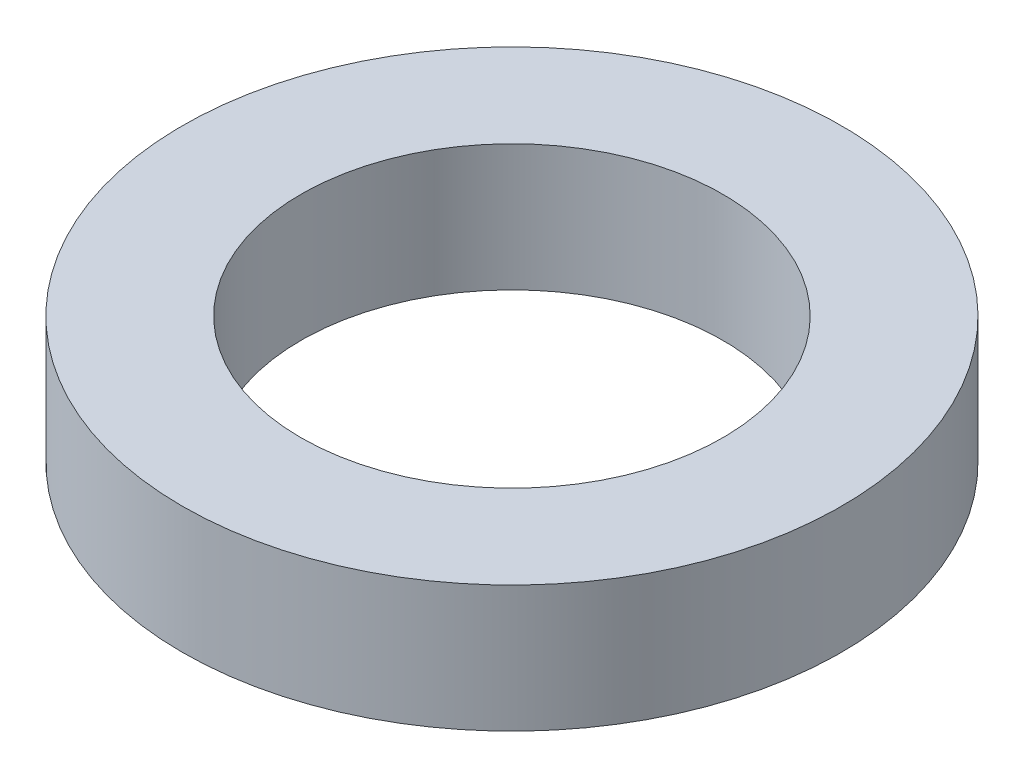
ISO-10303-21;
HEADER;
FILE_DESCRIPTION(('STEP AP214'),'2;1');
FILE_NAME('part.step','',(''),(''),'','','');
FILE_SCHEMA(('AUTOMOTIVE_DESIGN { 1 0 10303 214 1 1 1 1 }'));
ENDSEC;
DATA;
#1=APPLICATION_CONTEXT('core data for automotive mechanical design processes');
#2=APPLICATION_PROTOCOL_DEFINITION('international standard','automotive_design',2000,#1);
#3=PRODUCT_CONTEXT('',#1,'mechanical');
#4=PRODUCT('Part','Part','',(#3));
#5=PRODUCT_RELATED_PRODUCT_CATEGORY('part','',(#4));
#6=PRODUCT_DEFINITION_FORMATION('','',#4);
#7=PRODUCT_DEFINITION_CONTEXT('part definition',#1,'design');
#8=PRODUCT_DEFINITION('design','',#6,#7);
#9=PRODUCT_DEFINITION_SHAPE('','',#8);
#10=(LENGTH_UNIT() NAMED_UNIT(*) SI_UNIT(.MILLI.,.METRE.));
#11=(NAMED_UNIT(*) PLANE_ANGLE_UNIT() SI_UNIT($,.RADIAN.));
#12=(NAMED_UNIT(*) SI_UNIT($,.STERADIAN.) SOLID_ANGLE_UNIT());
#13=UNCERTAINTY_MEASURE_WITH_UNIT(LENGTH_MEASURE(1.E-05),#10,'distance_accuracy_value','');
#14=(GEOMETRIC_REPRESENTATION_CONTEXT(3) GLOBAL_UNCERTAINTY_ASSIGNED_CONTEXT((#13)) GLOBAL_UNIT_ASSIGNED_CONTEXT((#10,
#11,#12)) REPRESENTATION_CONTEXT('',''));
#15=CARTESIAN_POINT('',(0.,0.,0.));
#16=DIRECTION('',(0.,0.,1.));
#17=DIRECTION('',(1.,0.,0.));
#18=AXIS2_PLACEMENT_3D('',#15,#16,#17);
#19=CARTESIAN_POINT('',(0.,24.,0.));
#20=DIRECTION('',(0.,-1.,0.));
#21=DIRECTION('',(0.,0.,-1.));
#22=AXIS2_PLACEMENT_3D('',#19,#20,#21);
#23=CYLINDRICAL_SURFACE('',#22,62.5);
#24=CARTESIAN_POINT('',(0.,24.,0.));
#25=DIRECTION('',(0.,1.,0.));
#26=DIRECTION('',(0.,0.,1.));
#27=AXIS2_PLACEMENT_3D('',#24,#25,#26);
#28=CIRCLE('',#27,62.5);
#29=CARTESIAN_POINT('',(0.,24.,62.5));
#30=VERTEX_POINT('',#29);
#31=EDGE_CURVE('E10',#30,#30,#28,.T.);
#32=ORIENTED_EDGE('',*,*,#31,.F.);
#33=EDGE_LOOP('',(#32));
#34=FACE_BOUND('',#33,.T.);
#35=CARTESIAN_POINT('',(0.,0.,0.));
#36=DIRECTION('',(0.,1.,0.));
#37=DIRECTION('',(0.,0.,1.));
#38=AXIS2_PLACEMENT_3D('',#35,#36,#37);
#39=CIRCLE('',#38,62.5);
#40=CARTESIAN_POINT('',(0.,0.,62.5));
#41=VERTEX_POINT('',#40);
#42=EDGE_CURVE('E37',#41,#41,#39,.T.);
#43=ORIENTED_EDGE('',*,*,#42,.T.);
#44=EDGE_LOOP('',(#43));
#45=FACE_BOUND('',#44,.T.);
#46=ADVANCED_FACE('F40',(#34,#45),#23,.T.);
#47=CARTESIAN_POINT('',(0.,24.,0.));
#48=DIRECTION('',(0.,1.,0.));
#49=DIRECTION('',(0.,0.,1.));
#50=AXIS2_PLACEMENT_3D('',#47,#48,#49);
#51=PLANE('',#50);
#52=CARTESIAN_POINT('',(0.,24.,0.));
#53=DIRECTION('',(0.,1.,0.));
#54=DIRECTION('',(0.,0.,1.));
#55=AXIS2_PLACEMENT_3D('',#52,#53,#54);
#56=CIRCLE('',#55,40.);
#57=CARTESIAN_POINT('',(0.,24.,40.));
#58=VERTEX_POINT('',#57);
#59=EDGE_CURVE('E50',#58,#58,#56,.T.);
#60=ORIENTED_EDGE('',*,*,#59,.F.);
#61=EDGE_LOOP('',(#60));
#62=FACE_BOUND('',#61,.T.);
#63=ORIENTED_EDGE('',*,*,#31,.T.);
#64=EDGE_LOOP('',(#63));
#65=FACE_BOUND('',#64,.T.);
#66=ADVANCED_FACE('F59',(#62,#65),#51,.T.);
#67=CARTESIAN_POINT('',(0.,0.,0.));
#68=DIRECTION('',(0.,1.,0.));
#69=DIRECTION('',(0.,0.,1.));
#70=AXIS2_PLACEMENT_3D('',#67,#68,#69);
#71=PLANE('',#70);
#72=CARTESIAN_POINT('',(0.,0.,0.));
#73=DIRECTION('',(0.,1.,0.));
#74=DIRECTION('',(0.,0.,1.));
#75=AXIS2_PLACEMENT_3D('',#72,#73,#74);
#76=CIRCLE('',#75,40.);
#77=CARTESIAN_POINT('',(0.,0.,40.));
#78=VERTEX_POINT('',#77);
#79=EDGE_CURVE('E47',#78,#78,#76,.T.);
#80=ORIENTED_EDGE('',*,*,#79,.T.);
#81=EDGE_LOOP('',(#80));
#82=FACE_BOUND('',#81,.T.);
#83=ORIENTED_EDGE('',*,*,#42,.F.);
#84=EDGE_LOOP('',(#83));
#85=FACE_BOUND('',#84,.T.);
#86=ADVANCED_FACE('F58',(#82,#85),#71,.F.);
#87=CARTESIAN_POINT('',(0.,24.,0.));
#88=DIRECTION('',(0.,-1.,0.));
#89=DIRECTION('',(0.,0.,-1.));
#90=AXIS2_PLACEMENT_3D('',#87,#88,#89);
#91=CYLINDRICAL_SURFACE('',#90,40.);
#92=ORIENTED_EDGE('',*,*,#59,.T.);
#93=EDGE_LOOP('',(#92));
#94=FACE_BOUND('',#93,.T.);
#95=ORIENTED_EDGE('',*,*,#79,.F.);
#96=EDGE_LOOP('',(#95));
#97=FACE_BOUND('',#96,.T.);
#98=ADVANCED_FACE('F54',(#94,#97),#91,.F.);
#99=CLOSED_SHELL('',(#46,#66,#86,#98));
#100=MANIFOLD_SOLID_BREP('B2',#99);
#101=ADVANCED_BREP_SHAPE_REPRESENTATION('',(#18,#100),#14);
#102=SHAPE_DEFINITION_REPRESENTATION(#9,#101);
ENDSEC;
END-ISO-10303-21;
